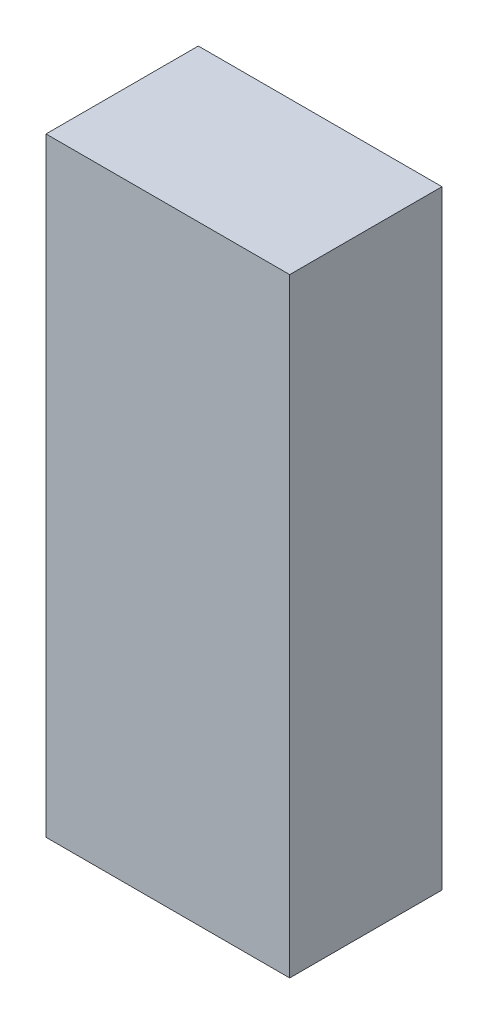
ISO-10303-21;
HEADER;
FILE_DESCRIPTION(('STEP AP214'),'2;1');
FILE_NAME('part.step','',(''),(''),'','','');
FILE_SCHEMA(('AUTOMOTIVE_DESIGN { 1 0 10303 214 1 1 1 1 }'));
ENDSEC;
DATA;
#1=APPLICATION_CONTEXT('core data for automotive mechanical design processes');
#2=APPLICATION_PROTOCOL_DEFINITION('international standard','automotive_design',2000,#1);
#3=PRODUCT_CONTEXT('',#1,'mechanical');
#4=PRODUCT('Part','Part','',(#3));
#5=PRODUCT_RELATED_PRODUCT_CATEGORY('part','',(#4));
#6=PRODUCT_DEFINITION_FORMATION('','',#4);
#7=PRODUCT_DEFINITION_CONTEXT('part definition',#1,'design');
#8=PRODUCT_DEFINITION('design','',#6,#7);
#9=PRODUCT_DEFINITION_SHAPE('','',#8);
#10=(LENGTH_UNIT() NAMED_UNIT(*) SI_UNIT(.MILLI.,.METRE.));
#11=(NAMED_UNIT(*) PLANE_ANGLE_UNIT() SI_UNIT($,.RADIAN.));
#12=(NAMED_UNIT(*) SI_UNIT($,.STERADIAN.) SOLID_ANGLE_UNIT());
#13=UNCERTAINTY_MEASURE_WITH_UNIT(LENGTH_MEASURE(1.E-05),#10,'distance_accuracy_value','');
#14=(GEOMETRIC_REPRESENTATION_CONTEXT(3) GLOBAL_UNCERTAINTY_ASSIGNED_CONTEXT((#13)) GLOBAL_UNIT_ASSIGNED_CONTEXT((#10,
#11,#12)) REPRESENTATION_CONTEXT('',''));
#15=CARTESIAN_POINT('',(0.,0.,0.));
#16=DIRECTION('',(0.,0.,1.));
#17=DIRECTION('',(1.,0.,0.));
#18=AXIS2_PLACEMENT_3D('',#15,#16,#17);
#19=CARTESIAN_POINT('',(0.,0.,4.7625));
#20=DIRECTION('',(1.,0.,0.));
#21=DIRECTION('',(0.,0.,-1.));
#22=AXIS2_PLACEMENT_3D('',#19,#20,#21);
#23=PLANE('',#22);
#24=DIRECTION('',(0.,-1.,0.));
#25=VECTOR('',#24,1.);
#26=CARTESIAN_POINT('',(0.,0.,0.));
#27=LINE('',#26,#25);
#28=CARTESIAN_POINT('',(0.,19.05,0.));
#29=VERTEX_POINT('',#28);
#30=CARTESIAN_POINT('',(0.,0.,0.));
#31=VERTEX_POINT('',#30);
#32=EDGE_CURVE('E114',#29,#31,#27,.T.);
#33=ORIENTED_EDGE('',*,*,#32,.T.);
#34=DIRECTION('',(0.,0.,-1.));
#35=VECTOR('',#34,1.);
#36=CARTESIAN_POINT('',(0.,0.,4.7625));
#37=LINE('',#36,#35);
#38=CARTESIAN_POINT('',(0.,0.,4.7625));
#39=VERTEX_POINT('',#38);
#40=EDGE_CURVE('E11',#39,#31,#37,.T.);
#41=ORIENTED_EDGE('',*,*,#40,.F.);
#42=DIRECTION('',(0.,-1.,0.));
#43=VECTOR('',#42,1.);
#44=CARTESIAN_POINT('',(0.,0.,4.7625));
#45=LINE('',#44,#43);
#46=CARTESIAN_POINT('',(0.,19.05,4.7625));
#47=VERTEX_POINT('',#46);
#48=EDGE_CURVE('E96',#47,#39,#45,.T.);
#49=ORIENTED_EDGE('',*,*,#48,.F.);
#50=DIRECTION('',(0.,0.,-1.));
#51=VECTOR('',#50,1.);
#52=CARTESIAN_POINT('',(0.,19.05,4.7625));
#53=LINE('',#52,#51);
#54=EDGE_CURVE('E110',#47,#29,#53,.T.);
#55=ORIENTED_EDGE('',*,*,#54,.T.);
#56=EDGE_LOOP('',(#33,#41,#49,#55));
#57=FACE_BOUND('',#56,.T.);
#58=ADVANCED_FACE('F44',(#57),#23,.F.);
#59=CARTESIAN_POINT('',(0.,0.,4.7625));
#60=DIRECTION('',(0.,1.,0.));
#61=DIRECTION('',(0.,0.,1.));
#62=AXIS2_PLACEMENT_3D('',#59,#60,#61);
#63=PLANE('',#62);
#64=DIRECTION('',(1.,0.,0.));
#65=VECTOR('',#64,1.);
#66=CARTESIAN_POINT('',(0.,0.,0.));
#67=LINE('',#66,#65);
#68=CARTESIAN_POINT('',(7.62,0.,0.));
#69=VERTEX_POINT('',#68);
#70=EDGE_CURVE('E101',#31,#69,#67,.T.);
#71=ORIENTED_EDGE('',*,*,#70,.T.);
#72=DIRECTION('',(0.,0.,-1.));
#73=VECTOR('',#72,1.);
#74=CARTESIAN_POINT('',(7.62,0.,4.7625));
#75=LINE('',#74,#73);
#76=CARTESIAN_POINT('',(7.62,0.,4.7625));
#77=VERTEX_POINT('',#76);
#78=EDGE_CURVE('E53',#77,#69,#75,.T.);
#79=ORIENTED_EDGE('',*,*,#78,.F.);
#80=DIRECTION('',(1.,0.,0.));
#81=VECTOR('',#80,1.);
#82=CARTESIAN_POINT('',(0.,0.,4.7625));
#83=LINE('',#82,#81);
#84=EDGE_CURVE('E91',#39,#77,#83,.T.);
#85=ORIENTED_EDGE('',*,*,#84,.F.);
#86=ORIENTED_EDGE('',*,*,#40,.T.);
#87=EDGE_LOOP('',(#71,#79,#85,#86));
#88=FACE_BOUND('',#87,.T.);
#89=ADVANCED_FACE('F100',(#88),#63,.F.);
#90=CARTESIAN_POINT('',(7.62,0.,4.7625));
#91=DIRECTION('',(-1.,0.,0.));
#92=DIRECTION('',(0.,0.,1.));
#93=AXIS2_PLACEMENT_3D('',#90,#91,#92);
#94=PLANE('',#93);
#95=DIRECTION('',(0.,1.,0.));
#96=VECTOR('',#95,1.);
#97=CARTESIAN_POINT('',(7.62,0.,0.));
#98=LINE('',#97,#96);
#99=CARTESIAN_POINT('',(7.62,19.05,0.));
#100=VERTEX_POINT('',#99);
#101=EDGE_CURVE('E78',#69,#100,#98,.T.);
#102=ORIENTED_EDGE('',*,*,#101,.T.);
#103=DIRECTION('',(0.,0.,-1.));
#104=VECTOR('',#103,1.);
#105=CARTESIAN_POINT('',(7.62,19.05,4.7625));
#106=LINE('',#105,#104);
#107=CARTESIAN_POINT('',(7.62,19.05,4.7625));
#108=VERTEX_POINT('',#107);
#109=EDGE_CURVE('E103',#108,#100,#106,.T.);
#110=ORIENTED_EDGE('',*,*,#109,.F.);
#111=DIRECTION('',(0.,1.,0.));
#112=VECTOR('',#111,1.);
#113=CARTESIAN_POINT('',(7.62,0.,4.7625));
#114=LINE('',#113,#112);
#115=EDGE_CURVE('E94',#77,#108,#114,.T.);
#116=ORIENTED_EDGE('',*,*,#115,.F.);
#117=ORIENTED_EDGE('',*,*,#78,.T.);
#118=EDGE_LOOP('',(#102,#110,#116,#117));
#119=FACE_BOUND('',#118,.T.);
#120=ADVANCED_FACE('F104',(#119),#94,.F.);
#121=CARTESIAN_POINT('',(0.,19.05,4.7625));
#122=DIRECTION('',(0.,-1.,0.));
#123=DIRECTION('',(0.,0.,-1.));
#124=AXIS2_PLACEMENT_3D('',#121,#122,#123);
#125=PLANE('',#124);
#126=DIRECTION('',(-1.,0.,0.));
#127=VECTOR('',#126,1.);
#128=CARTESIAN_POINT('',(0.,19.05,0.));
#129=LINE('',#128,#127);
#130=EDGE_CURVE('E84',#100,#29,#129,.T.);
#131=ORIENTED_EDGE('',*,*,#130,.T.);
#132=ORIENTED_EDGE('',*,*,#54,.F.);
#133=DIRECTION('',(-1.,0.,0.));
#134=VECTOR('',#133,1.);
#135=CARTESIAN_POINT('',(0.,19.05,4.7625));
#136=LINE('',#135,#134);
#137=EDGE_CURVE('E61',#108,#47,#136,.T.);
#138=ORIENTED_EDGE('',*,*,#137,.F.);
#139=ORIENTED_EDGE('',*,*,#109,.T.);
#140=EDGE_LOOP('',(#131,#132,#138,#139));
#141=FACE_BOUND('',#140,.T.);
#142=ADVANCED_FACE('F129',(#141),#125,.F.);
#143=CARTESIAN_POINT('',(0.,0.,4.7625));
#144=DIRECTION('',(0.,0.,-1.));
#145=DIRECTION('',(-1.,0.,0.));
#146=AXIS2_PLACEMENT_3D('',#143,#144,#145);
#147=PLANE('',#146);
#148=ORIENTED_EDGE('',*,*,#48,.T.);
#149=ORIENTED_EDGE('',*,*,#84,.T.);
#150=ORIENTED_EDGE('',*,*,#115,.T.);
#151=ORIENTED_EDGE('',*,*,#137,.T.);
#152=EDGE_LOOP('',(#148,#149,#150,#151));
#153=FACE_BOUND('',#152,.T.);
#154=ADVANCED_FACE('F92',(#153),#147,.F.);
#155=CARTESIAN_POINT('',(0.,0.,0.));
#156=DIRECTION('',(0.,0.,-1.));
#157=DIRECTION('',(-1.,0.,0.));
#158=AXIS2_PLACEMENT_3D('',#155,#156,#157);
#159=PLANE('',#158);
#160=ORIENTED_EDGE('',*,*,#32,.F.);
#161=ORIENTED_EDGE('',*,*,#130,.F.);
#162=ORIENTED_EDGE('',*,*,#101,.F.);
#163=ORIENTED_EDGE('',*,*,#70,.F.);
#164=EDGE_LOOP('',(#160,#161,#162,#163));
#165=FACE_BOUND('',#164,.T.);
#166=ADVANCED_FACE('F132',(#165),#159,.T.);
#167=CLOSED_SHELL('',(#58,#89,#120,#142,#154,#166));
#168=MANIFOLD_SOLID_BREP('B2',#167);
#169=ADVANCED_BREP_SHAPE_REPRESENTATION('',(#18,#168),#14);
#170=SHAPE_DEFINITION_REPRESENTATION(#9,#169);
ENDSEC;
END-ISO-10303-21;
